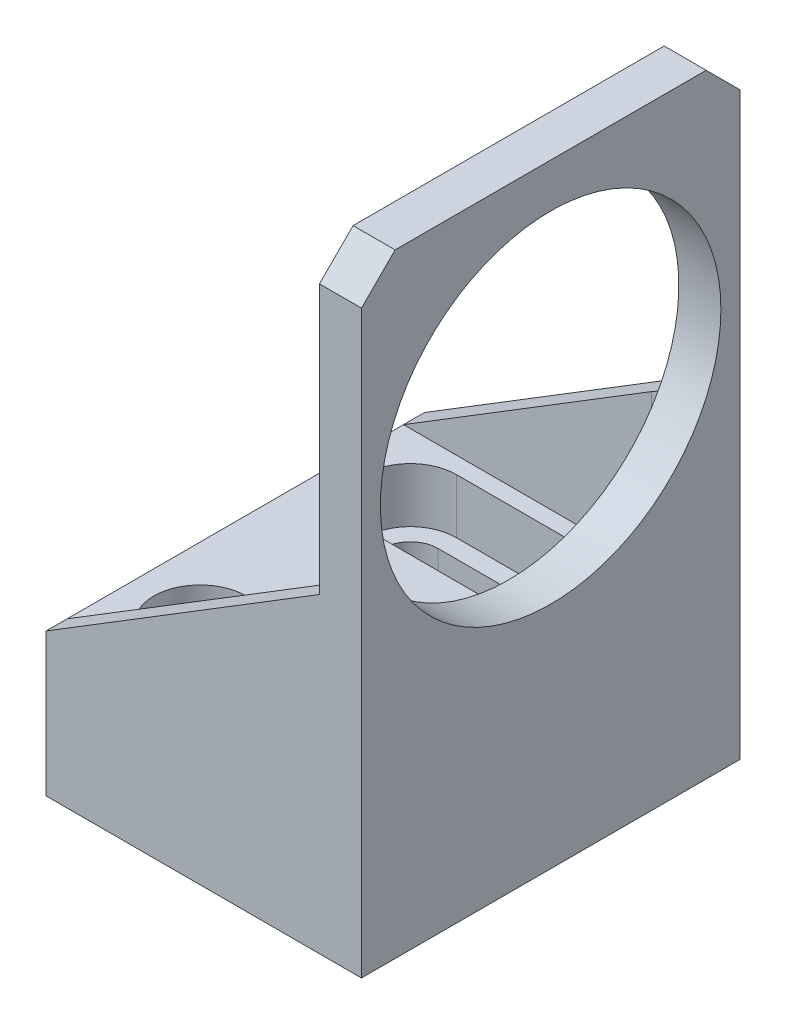
ISO-10303-21;
HEADER;
FILE_DESCRIPTION(('STEP AP214'),'2;1');
FILE_NAME('part.step','',(''),(''),'','','');
FILE_SCHEMA(('AUTOMOTIVE_DESIGN { 1 0 10303 214 1 1 1 1 }'));
ENDSEC;
DATA;
#1=APPLICATION_CONTEXT('core data for automotive mechanical design processes');
#2=APPLICATION_PROTOCOL_DEFINITION('international standard','automotive_design',2000,#1);
#3=PRODUCT_CONTEXT('',#1,'mechanical');
#4=PRODUCT('Part','Part','',(#3));
#5=PRODUCT_RELATED_PRODUCT_CATEGORY('part','',(#4));
#6=PRODUCT_DEFINITION_FORMATION('','',#4);
#7=PRODUCT_DEFINITION_CONTEXT('part definition',#1,'design');
#8=PRODUCT_DEFINITION('design','',#6,#7);
#9=PRODUCT_DEFINITION_SHAPE('','',#8);
#10=(LENGTH_UNIT() NAMED_UNIT(*) SI_UNIT(.MILLI.,.METRE.));
#11=(NAMED_UNIT(*) PLANE_ANGLE_UNIT() SI_UNIT($,.RADIAN.));
#12=(NAMED_UNIT(*) SI_UNIT($,.STERADIAN.) SOLID_ANGLE_UNIT());
#13=UNCERTAINTY_MEASURE_WITH_UNIT(LENGTH_MEASURE(1.E-05),#10,'distance_accuracy_value','');
#14=(GEOMETRIC_REPRESENTATION_CONTEXT(3) GLOBAL_UNCERTAINTY_ASSIGNED_CONTEXT((#13)) GLOBAL_UNIT_ASSIGNED_CONTEXT((#10,
#11,#12)) REPRESENTATION_CONTEXT('',''));
#15=CARTESIAN_POINT('',(0.,0.,0.));
#16=DIRECTION('',(0.,0.,1.));
#17=DIRECTION('',(1.,0.,0.));
#18=AXIS2_PLACEMENT_3D('',#15,#16,#17);
#19=CARTESIAN_POINT('',(0.,0.,0.));
#20=DIRECTION('',(-1.,0.,0.));
#21=DIRECTION('',(0.,0.,1.));
#22=AXIS2_PLACEMENT_3D('',#19,#20,#21);
#23=PLANE('',#22);
#24=DIRECTION('',(0.,0.,-1.));
#25=VECTOR('',#24,1.);
#26=CARTESIAN_POINT('',(0.,37.,-20.));
#27=LINE('',#26,#25);
#28=CARTESIAN_POINT('',(0.,37.,-17.3150945709228));
#29=VERTEX_POINT('',#28);
#30=CARTESIAN_POINT('',(0.,37.,-22.5));
#31=VERTEX_POINT('',#30);
#32=EDGE_CURVE('E213',#29,#31,#27,.T.);
#33=ORIENTED_EDGE('',*,*,#32,.F.);
#34=CARTESIAN_POINT('',(0.,47.5,0.));
#35=DIRECTION('',(1.,0.,0.));
#36=DIRECTION('',(0.,0.,-1.));
#37=AXIS2_PLACEMENT_3D('',#34,#35,#36);
#38=CIRCLE('',#37,20.25);
#39=CARTESIAN_POINT('',(0.,37.,17.3150945709228));
#40=VERTEX_POINT('',#39);
#41=EDGE_CURVE('E435',#29,#40,#38,.T.);
#42=ORIENTED_EDGE('',*,*,#41,.T.);
#43=DIRECTION('',(0.,0.,1.));
#44=VECTOR('',#43,1.);
#45=CARTESIAN_POINT('',(0.,37.,20.));
#46=LINE('',#45,#44);
#47=CARTESIAN_POINT('',(0.,37.,22.5));
#48=VERTEX_POINT('',#47);
#49=EDGE_CURVE('E616',#40,#48,#46,.T.);
#50=ORIENTED_EDGE('',*,*,#49,.T.);
#51=DIRECTION('',(0.,-1.,0.));
#52=VECTOR('',#51,1.);
#53=CARTESIAN_POINT('',(0.,0.,22.5));
#54=LINE('',#53,#52);
#55=CARTESIAN_POINT('',(0.,69.,22.5));
#56=VERTEX_POINT('',#55);
#57=EDGE_CURVE('E449',#56,#48,#54,.T.);
#58=ORIENTED_EDGE('',*,*,#57,.F.);
#59=DIRECTION('',(0.,-0.707106781186546,0.707106781186549));
#60=VECTOR('',#59,1.);
#61=CARTESIAN_POINT('',(0.,45.7500000000002,45.7499999999999));
#62=LINE('',#61,#60);
#63=CARTESIAN_POINT('',(0.,73.,18.5));
#64=VERTEX_POINT('',#63);
#65=EDGE_CURVE('E491',#56,#64,#62,.F.);
#66=ORIENTED_EDGE('',*,*,#65,.T.);
#67=DIRECTION('',(0.,0.,1.));
#68=VECTOR('',#67,1.);
#69=CARTESIAN_POINT('',(0.,73.,22.5));
#70=LINE('',#69,#68);
#71=CARTESIAN_POINT('',(0.,73.,-18.5));
#72=VERTEX_POINT('',#71);
#73=EDGE_CURVE('E458',#72,#64,#70,.T.);
#74=ORIENTED_EDGE('',*,*,#73,.F.);
#75=DIRECTION('',(0.,0.707106781186548,0.707106781186547));
#76=VECTOR('',#75,1.);
#77=CARTESIAN_POINT('',(0.,45.7499999999999,-45.75));
#78=LINE('',#77,#76);
#79=CARTESIAN_POINT('',(0.,69.,-22.5));
#80=VERTEX_POINT('',#79);
#81=EDGE_CURVE('E494',#72,#80,#78,.F.);
#82=ORIENTED_EDGE('',*,*,#81,.T.);
#83=DIRECTION('',(0.,1.,0.));
#84=VECTOR('',#83,1.);
#85=CARTESIAN_POINT('',(0.,0.,-22.5));
#86=LINE('',#85,#84);
#87=EDGE_CURVE('E473',#31,#80,#86,.T.);
#88=ORIENTED_EDGE('',*,*,#87,.F.);
#89=EDGE_LOOP('',(#33,#42,#50,#58,#66,#74,#82,#88));
#90=FACE_BOUND('',#89,.T.);
#91=ADVANCED_FACE('F189',(#90),#23,.T.);
#92=CARTESIAN_POINT('',(0.,36.4971594576673,17.));
#93=VERTEX_POINT('',#92);
#94=CARTESIAN_POINT('',(0.,36.4971594576673,-17.));
#95=VERTEX_POINT('',#94);
#96=EDGE_CURVE('E450',#93,#95,#38,.T.);
#97=ORIENTED_EDGE('',*,*,#96,.T.);
#98=DIRECTION('',(0.,1.,0.));
#99=VECTOR('',#98,1.);
#100=CARTESIAN_POINT('',(0.,17.,-17.));
#101=LINE('',#100,#99);
#102=CARTESIAN_POINT('',(0.,17.,-17.));
#103=VERTEX_POINT('',#102);
#104=EDGE_CURVE('E589',#95,#103,#101,.F.);
#105=ORIENTED_EDGE('',*,*,#104,.T.);
#106=DIRECTION('',(0.,0.,1.));
#107=VECTOR('',#106,1.);
#108=CARTESIAN_POINT('',(0.,17.,-22.5));
#109=LINE('',#108,#107);
#110=CARTESIAN_POINT('',(0.,17.,17.));
#111=VERTEX_POINT('',#110);
#112=EDGE_CURVE('E440',#103,#111,#109,.T.);
#113=ORIENTED_EDGE('',*,*,#112,.T.);
#114=DIRECTION('',(0.,1.,0.));
#115=VECTOR('',#114,1.);
#116=CARTESIAN_POINT('',(0.,37.,17.));
#117=LINE('',#116,#115);
#118=EDGE_CURVE('E543',#111,#93,#117,.T.);
#119=ORIENTED_EDGE('',*,*,#118,.T.);
#120=EDGE_LOOP('',(#97,#105,#113,#119));
#121=FACE_BOUND('',#120,.T.);
#122=ADVANCED_FACE('F790',(#121),#23,.T.);
#123=CARTESIAN_POINT('',(5.,0.,0.));
#124=DIRECTION('',(-1.,0.,0.));
#125=DIRECTION('',(0.,0.,1.));
#126=AXIS2_PLACEMENT_3D('',#123,#124,#125);
#127=PLANE('',#126);
#128=DIRECTION('',(0.,1.,0.));
#129=VECTOR('',#128,1.);
#130=CARTESIAN_POINT('',(5.,0.,-22.5));
#131=LINE('',#130,#129);
#132=CARTESIAN_POINT('',(5.,0.,-22.5));
#133=VERTEX_POINT('',#132);
#134=CARTESIAN_POINT('',(5.,69.,-22.5));
#135=VERTEX_POINT('',#134);
#136=EDGE_CURVE('E461',#133,#135,#131,.T.);
#137=ORIENTED_EDGE('',*,*,#136,.T.);
#138=DIRECTION('',(0.,-0.707106781186548,-0.707106781186547));
#139=VECTOR('',#138,1.);
#140=CARTESIAN_POINT('',(5.,73.,-18.5));
#141=LINE('',#140,#139);
#142=CARTESIAN_POINT('',(5.,73.,-18.5));
#143=VERTEX_POINT('',#142);
#144=EDGE_CURVE('E504',#135,#143,#141,.F.);
#145=ORIENTED_EDGE('',*,*,#144,.T.);
#146=DIRECTION('',(0.,0.,1.));
#147=VECTOR('',#146,1.);
#148=CARTESIAN_POINT('',(5.,73.,22.5));
#149=LINE('',#148,#147);
#150=CARTESIAN_POINT('',(5.,73.,18.5));
#151=VERTEX_POINT('',#150);
#152=EDGE_CURVE('E465',#143,#151,#149,.T.);
#153=ORIENTED_EDGE('',*,*,#152,.T.);
#154=DIRECTION('',(0.,0.707106781186546,-0.707106781186549));
#155=VECTOR('',#154,1.);
#156=CARTESIAN_POINT('',(5.,69.,22.5));
#157=LINE('',#156,#155);
#158=CARTESIAN_POINT('',(5.,69.,22.5));
#159=VERTEX_POINT('',#158);
#160=EDGE_CURVE('E501',#151,#159,#157,.F.);
#161=ORIENTED_EDGE('',*,*,#160,.T.);
#162=DIRECTION('',(0.,-1.,0.));
#163=VECTOR('',#162,1.);
#164=CARTESIAN_POINT('',(5.,0.,22.5));
#165=LINE('',#164,#163);
#166=CARTESIAN_POINT('',(5.,0.,22.5));
#167=VERTEX_POINT('',#166);
#168=EDGE_CURVE('E454',#159,#167,#165,.T.);
#169=ORIENTED_EDGE('',*,*,#168,.T.);
#170=DIRECTION('',(0.,0.,-1.));
#171=VECTOR('',#170,1.);
#172=CARTESIAN_POINT('',(5.,0.,22.5));
#173=LINE('',#172,#171);
#174=EDGE_CURVE('E457',#167,#133,#173,.T.);
#175=ORIENTED_EDGE('',*,*,#174,.T.);
#176=EDGE_LOOP('',(#137,#145,#153,#161,#169,#175));
#177=FACE_BOUND('',#176,.T.);
#178=CARTESIAN_POINT('',(5.,47.5,0.));
#179=DIRECTION('',(1.,0.,0.));
#180=DIRECTION('',(0.,0.,-1.));
#181=AXIS2_PLACEMENT_3D('',#178,#179,#180);
#182=CIRCLE('',#181,20.25);
#183=CARTESIAN_POINT('',(5.,47.5,-20.25));
#184=VERTEX_POINT('',#183);
#185=EDGE_CURVE('E445',#184,#184,#182,.T.);
#186=ORIENTED_EDGE('',*,*,#185,.F.);
#187=EDGE_LOOP('',(#186));
#188=FACE_BOUND('',#187,.T.);
#189=ADVANCED_FACE('F576',(#177,#188),#127,.F.);
#190=CARTESIAN_POINT('',(5.,0.,22.5));
#191=DIRECTION('',(0.,0.,-1.));
#192=DIRECTION('',(-1.,0.,0.));
#193=AXIS2_PLACEMENT_3D('',#190,#191,#192);
#194=PLANE('',#193);
#195=ORIENTED_EDGE('',*,*,#57,.T.);
#196=DIRECTION('',(-0.851658316704544,-0.524097425664335,0.));
#197=VECTOR('',#196,1.);
#198=CARTESIAN_POINT('',(0.,37.,22.5));
#199=LINE('',#198,#197);
#200=CARTESIAN_POINT('',(-32.5,17.,22.5));
#201=VERTEX_POINT('',#200);
#202=EDGE_CURVE('E611',#48,#201,#199,.T.);
#203=ORIENTED_EDGE('',*,*,#202,.T.);
#204=DIRECTION('',(0.,-1.,0.));
#205=VECTOR('',#204,1.);
#206=CARTESIAN_POINT('',(-32.5,17.,22.5));
#207=LINE('',#206,#205);
#208=CARTESIAN_POINT('',(-32.5,0.,22.5));
#209=VERTEX_POINT('',#208);
#210=EDGE_CURVE('E432',#201,#209,#207,.T.);
#211=ORIENTED_EDGE('',*,*,#210,.T.);
#212=DIRECTION('',(-1.,0.,0.));
#213=VECTOR('',#212,1.);
#214=CARTESIAN_POINT('',(5.,0.,22.5));
#215=LINE('',#214,#213);
#216=EDGE_CURVE('E481',#167,#209,#215,.T.);
#217=ORIENTED_EDGE('',*,*,#216,.F.);
#218=ORIENTED_EDGE('',*,*,#168,.F.);
#219=DIRECTION('',(-1.,0.,0.));
#220=VECTOR('',#219,1.);
#221=CARTESIAN_POINT('',(5.,69.,22.5));
#222=LINE('',#221,#220);
#223=EDGE_CURVE('E507',#159,#56,#222,.T.);
#224=ORIENTED_EDGE('',*,*,#223,.T.);
#225=EDGE_LOOP('',(#195,#203,#211,#217,#218,#224));
#226=FACE_BOUND('',#225,.T.);
#227=ADVANCED_FACE('F783',(#226),#194,.F.);
#228=CARTESIAN_POINT('',(5.,0.,22.5));
#229=DIRECTION('',(0.,1.,0.));
#230=DIRECTION('',(0.,0.,1.));
#231=AXIS2_PLACEMENT_3D('',#228,#229,#230);
#232=PLANE('',#231);
#233=CARTESIAN_POINT('',(-5.8,0.,-12.5));
#234=DIRECTION('',(0.,1.,0.));
#235=DIRECTION('',(0.,0.,1.));
#236=AXIS2_PLACEMENT_3D('',#233,#234,#235);
#237=CIRCLE('',#236,3.3);
#238=CARTESIAN_POINT('',(-5.8,0.,-9.2));
#239=VERTEX_POINT('',#238);
#240=CARTESIAN_POINT('',(-5.8,0.,-15.8));
#241=VERTEX_POINT('',#240);
#242=EDGE_CURVE('E535',#239,#241,#237,.T.);
#243=ORIENTED_EDGE('',*,*,#242,.T.);
#244=DIRECTION('',(-1.,0.,0.));
#245=VECTOR('',#244,1.);
#246=CARTESIAN_POINT('',(5.,0.,-15.8));
#247=LINE('',#246,#245);
#248=CARTESIAN_POINT('',(-24.2,0.,-15.8));
#249=VERTEX_POINT('',#248);
#250=EDGE_CURVE('E539',#241,#249,#247,.T.);
#251=ORIENTED_EDGE('',*,*,#250,.T.);
#252=CARTESIAN_POINT('',(-24.2,0.,-12.5));
#253=DIRECTION('',(0.,1.,0.));
#254=DIRECTION('',(0.,0.,1.));
#255=AXIS2_PLACEMENT_3D('',#252,#253,#254);
#256=CIRCLE('',#255,3.3);
#257=CARTESIAN_POINT('',(-24.2,0.,-9.20000000000001));
#258=VERTEX_POINT('',#257);
#259=EDGE_CURVE('E531',#249,#258,#256,.T.);
#260=ORIENTED_EDGE('',*,*,#259,.T.);
#261=DIRECTION('',(1.,0.,0.));
#262=VECTOR('',#261,1.);
#263=CARTESIAN_POINT('',(5.,0.,-9.20000000000001));
#264=LINE('',#263,#262);
#265=EDGE_CURVE('E527',#258,#239,#264,.T.);
#266=ORIENTED_EDGE('',*,*,#265,.T.);
#267=EDGE_LOOP('',(#243,#251,#260,#266));
#268=FACE_BOUND('',#267,.T.);
#269=CARTESIAN_POINT('',(-5.8,0.,12.5));
#270=DIRECTION('',(0.,1.,0.));
#271=DIRECTION('',(0.,0.,1.));
#272=AXIS2_PLACEMENT_3D('',#269,#270,#271);
#273=CIRCLE('',#272,3.3);
#274=CARTESIAN_POINT('',(-5.8,0.,15.8));
#275=VERTEX_POINT('',#274);
#276=CARTESIAN_POINT('',(-5.8,0.,9.2));
#277=VERTEX_POINT('',#276);
#278=EDGE_CURVE('E519',#275,#277,#273,.T.);
#279=ORIENTED_EDGE('',*,*,#278,.T.);
#280=DIRECTION('',(-1.,0.,0.));
#281=VECTOR('',#280,1.);
#282=CARTESIAN_POINT('',(5.,0.,9.2));
#283=LINE('',#282,#281);
#284=CARTESIAN_POINT('',(-24.2,0.,9.2));
#285=VERTEX_POINT('',#284);
#286=EDGE_CURVE('E523',#277,#285,#283,.T.);
#287=ORIENTED_EDGE('',*,*,#286,.T.);
#288=CARTESIAN_POINT('',(-24.2,0.,12.5));
#289=DIRECTION('',(0.,1.,0.));
#290=DIRECTION('',(0.,0.,1.));
#291=AXIS2_PLACEMENT_3D('',#288,#289,#290);
#292=CIRCLE('',#291,3.3);
#293=CARTESIAN_POINT('',(-24.2,0.,15.8));
#294=VERTEX_POINT('',#293);
#295=EDGE_CURVE('E515',#285,#294,#292,.T.);
#296=ORIENTED_EDGE('',*,*,#295,.T.);
#297=DIRECTION('',(1.,0.,0.));
#298=VECTOR('',#297,1.);
#299=CARTESIAN_POINT('',(5.,0.,15.8));
#300=LINE('',#299,#298);
#301=EDGE_CURVE('E511',#294,#275,#300,.T.);
#302=ORIENTED_EDGE('',*,*,#301,.T.);
#303=EDGE_LOOP('',(#279,#287,#296,#302));
#304=FACE_BOUND('',#303,.T.);
#305=ORIENTED_EDGE('',*,*,#216,.T.);
#306=DIRECTION('',(0.,0.,-1.));
#307=VECTOR('',#306,1.);
#308=CARTESIAN_POINT('',(-32.5,0.,22.5));
#309=LINE('',#308,#307);
#310=CARTESIAN_POINT('',(-32.5,0.,-22.5));
#311=VERTEX_POINT('',#310);
#312=EDGE_CURVE('E443',#209,#311,#309,.T.);
#313=ORIENTED_EDGE('',*,*,#312,.T.);
#314=DIRECTION('',(-1.,0.,0.));
#315=VECTOR('',#314,1.);
#316=CARTESIAN_POINT('',(5.,0.,-22.5));
#317=LINE('',#316,#315);
#318=EDGE_CURVE('E469',#133,#311,#317,.T.);
#319=ORIENTED_EDGE('',*,*,#318,.F.);
#320=ORIENTED_EDGE('',*,*,#174,.F.);
#321=EDGE_LOOP('',(#305,#313,#319,#320));
#322=FACE_BOUND('',#321,.T.);
#323=ADVANCED_FACE('F812',(#268,#304,#322),#232,.F.);
#324=CARTESIAN_POINT('',(5.,0.,-22.5));
#325=DIRECTION('',(0.,0.,1.));
#326=DIRECTION('',(1.,0.,0.));
#327=AXIS2_PLACEMENT_3D('',#324,#325,#326);
#328=PLANE('',#327);
#329=DIRECTION('',(-0.851658316704544,-0.524097425664335,0.));
#330=VECTOR('',#329,1.);
#331=CARTESIAN_POINT('',(0.,37.,-22.5));
#332=LINE('',#331,#330);
#333=CARTESIAN_POINT('',(-32.5,17.,-22.5));
#334=VERTEX_POINT('',#333);
#335=EDGE_CURVE('E426',#31,#334,#332,.T.);
#336=ORIENTED_EDGE('',*,*,#335,.F.);
#337=ORIENTED_EDGE('',*,*,#87,.T.);
#338=DIRECTION('',(1.,0.,0.));
#339=VECTOR('',#338,1.);
#340=CARTESIAN_POINT('',(5.,69.,-22.5));
#341=LINE('',#340,#339);
#342=EDGE_CURVE('E498',#80,#135,#341,.T.);
#343=ORIENTED_EDGE('',*,*,#342,.T.);
#344=ORIENTED_EDGE('',*,*,#136,.F.);
#345=ORIENTED_EDGE('',*,*,#318,.T.);
#346=DIRECTION('',(0.,1.,0.));
#347=VECTOR('',#346,1.);
#348=CARTESIAN_POINT('',(-32.5,0.,-22.5));
#349=LINE('',#348,#347);
#350=EDGE_CURVE('E418',#311,#334,#349,.T.);
#351=ORIENTED_EDGE('',*,*,#350,.T.);
#352=EDGE_LOOP('',(#336,#337,#343,#344,#345,#351));
#353=FACE_BOUND('',#352,.T.);
#354=ADVANCED_FACE('F779',(#353),#328,.F.);
#355=CARTESIAN_POINT('',(5.,73.,22.5));
#356=DIRECTION('',(0.,-1.,0.));
#357=DIRECTION('',(0.,0.,-1.));
#358=AXIS2_PLACEMENT_3D('',#355,#356,#357);
#359=PLANE('',#358);
#360=ORIENTED_EDGE('',*,*,#152,.F.);
#361=DIRECTION('',(-1.,0.,0.));
#362=VECTOR('',#361,1.);
#363=CARTESIAN_POINT('',(5.,73.,-18.5));
#364=LINE('',#363,#362);
#365=EDGE_CURVE('E487',#143,#72,#364,.T.);
#366=ORIENTED_EDGE('',*,*,#365,.T.);
#367=ORIENTED_EDGE('',*,*,#73,.T.);
#368=DIRECTION('',(1.,0.,0.));
#369=VECTOR('',#368,1.);
#370=CARTESIAN_POINT('',(5.,73.,18.5));
#371=LINE('',#370,#369);
#372=EDGE_CURVE('E484',#64,#151,#371,.T.);
#373=ORIENTED_EDGE('',*,*,#372,.T.);
#374=EDGE_LOOP('',(#360,#366,#367,#373));
#375=FACE_BOUND('',#374,.T.);
#376=ADVANCED_FACE('F573',(#375),#359,.F.);
#377=CARTESIAN_POINT('',(5.,47.5,0.));
#378=DIRECTION('',(-1.,0.,0.));
#379=DIRECTION('',(0.,0.,1.));
#380=AXIS2_PLACEMENT_3D('',#377,#378,#379);
#381=CYLINDRICAL_SURFACE('',#380,20.25);
#382=ORIENTED_EDGE('',*,*,#185,.T.);
#383=EDGE_LOOP('',(#382));
#384=FACE_BOUND('',#383,.T.);
#385=ORIENTED_EDGE('',*,*,#96,.F.);
#386=CARTESIAN_POINT('',(0.,36.4971594576673,17.));
#387=CARTESIAN_POINT('',(-1.87730750983537E-05,36.631778714722,17.0871342220285));
#388=CARTESIAN_POINT('',(-0.00379528812989197,36.767408182586,17.172643217437));
#389=CARTESIAN_POINT('',(-0.0181651697236299,37.0403457240913,17.3402341699975));
#390=CARTESIAN_POINT('',(-0.0287559085618988,37.177653130672,17.4223174351923));
#391=CARTESIAN_POINT('',(-0.0559711898135035,37.4528443621998,17.5824446473561));
#392=CARTESIAN_POINT('',(-0.0725575221623428,37.5907191892968,17.6605106752522));
#393=CARTESIAN_POINT('',(-0.111211779846979,37.8676692726443,17.8130769428276));
#394=CARTESIAN_POINT('',(-0.133280247611083,38.0067446463674,17.8875768287856));
#395=CARTESIAN_POINT('',(-0.206929316997403,38.4253438365513,18.1055795781002));
#396=CARTESIAN_POINT('',(-0.265972374079489,38.706417750355,18.2436883861877));
#397=CARTESIAN_POINT('',(-0.367318591546826,39.1308662044017,18.440299905632));
#398=CARTESIAN_POINT('',(-0.403368954259783,39.2732888568415,18.5042687277381));
#399=CARTESIAN_POINT('',(-0.47944165155369,39.5586589279134,18.628521196671));
#400=CARTESIAN_POINT('',(-0.519463491237028,39.7016062790286,18.6888053011522));
#401=CARTESIAN_POINT('',(-0.56134061130716,39.8447732222212,18.747266546907));
#402=B_SPLINE_CURVE_WITH_KNOTS('',3,(#386,#387,#388,#389,#390,#391,#392,#393,#394,#395,#396,
#397,#398,#399,#400,#401),.UNSPECIFIED.,.F.,.F.,(4,2,2,2,2,2,2,4),(0.,0.480967981834138,
0.961750603885109,1.43952170005934,1.91734008799896,2.87236178698792,3.35300280856096,
3.83358401105418),.UNSPECIFIED.);
#403=CARTESIAN_POINT('',(-0.0159695356537035,36.9901725934439,17.3091313440161));
#404=VERTEX_POINT('',#403);
#405=EDGE_CURVE('E554',#93,#404,#402,.T.);
#406=ORIENTED_EDGE('',*,*,#405,.T.);
#407=CARTESIAN_POINT('',(17.0625,47.5,0.));
#408=DIRECTION('',(-0.524097425664335,0.851658316704544,0.));
#409=DIRECTION('',(-0.851658316704544,-0.524097425664335,0.));
#410=AXIS2_PLACEMENT_3D('',#407,#408,#409);
#411=ELLIPSE('',#410,38.6378543537617,20.25);
#412=EDGE_CURVE('E593',#40,#404,#411,.F.);
#413=ORIENTED_EDGE('',*,*,#412,.F.);
#414=ORIENTED_EDGE('',*,*,#41,.F.);
#415=CARTESIAN_POINT('',(17.0625,47.5,0.));
#416=DIRECTION('',(0.524097425664335,-0.851658316704544,0.));
#417=DIRECTION('',(-0.851658316704544,-0.524097425664335,0.));
#418=AXIS2_PLACEMENT_3D('',#415,#416,#417);
#419=ELLIPSE('',#418,38.6378543537617,20.25);
#420=CARTESIAN_POINT('',(-0.0159695356537035,36.9901725934439,-17.3091313440161));
#421=VERTEX_POINT('',#420);
#422=EDGE_CURVE('E13',#29,#421,#419,.F.);
#423=ORIENTED_EDGE('',*,*,#422,.T.);
#424=CARTESIAN_POINT('',(0.,36.4971594576673,-17.));
#425=CARTESIAN_POINT('',(-1.87730750983537E-05,36.631778714722,-17.0871342220285));
#426=CARTESIAN_POINT('',(-0.00379528812989197,36.767408182586,-17.172643217437));
#427=CARTESIAN_POINT('',(-0.0181651697236299,37.0403457240913,-17.3402341699975));
#428=CARTESIAN_POINT('',(-0.0287559085618988,37.177653130672,-17.4223174351923));
#429=CARTESIAN_POINT('',(-0.0559711898135035,37.4528443621998,-17.5824446473561));
#430=CARTESIAN_POINT('',(-0.0725575221623428,37.5907191892968,-17.6605106752522));
#431=CARTESIAN_POINT('',(-0.111211779846979,37.8676692726443,-17.8130769428276));
#432=CARTESIAN_POINT('',(-0.133280247611083,38.0067446463674,-17.8875768287856));
#433=CARTESIAN_POINT('',(-0.206929316997403,38.4253438365513,-18.1055795781002));
#434=CARTESIAN_POINT('',(-0.265972374079489,38.706417750355,-18.2436883861877));
#435=CARTESIAN_POINT('',(-0.367318591546826,39.1308662044017,-18.440299905632));
#436=CARTESIAN_POINT('',(-0.403368954259783,39.2732888568415,-18.5042687277381));
#437=CARTESIAN_POINT('',(-0.47944165155369,39.5586589279134,-18.628521196671));
#438=CARTESIAN_POINT('',(-0.519463491237028,39.7016062790286,-18.6888053011522));
#439=CARTESIAN_POINT('',(-0.56134061130716,39.8447732222212,-18.747266546907));
#440=B_SPLINE_CURVE_WITH_KNOTS('',3,(#424,#425,#426,#427,#428,#429,#430,#431,#432,#433,#434,
#435,#436,#437,#438,#439),.UNSPECIFIED.,.F.,.F.,(4,2,2,2,2,2,2,4),(0.,0.480967981834138,
0.961750603885109,1.43952170005934,1.91734008799896,2.87236178698792,3.35300280856096,
3.83358401105418),.UNSPECIFIED.);
#441=EDGE_CURVE('E199',#421,#95,#440,.F.);
#442=ORIENTED_EDGE('',*,*,#441,.T.);
#443=EDGE_LOOP('',(#385,#406,#413,#414,#423,#442));
#444=FACE_BOUND('',#443,.T.);
#445=ADVANCED_FACE('F567',(#384,#444),#381,.F.);
#446=CARTESIAN_POINT('',(5.,73.,-18.5));
#447=DIRECTION('',(0.,-0.707106781186547,0.707106781186548));
#448=DIRECTION('',(-1.,0.,0.));
#449=AXIS2_PLACEMENT_3D('',#446,#447,#448);
#450=PLANE('',#449);
#451=ORIENTED_EDGE('',*,*,#144,.F.);
#452=ORIENTED_EDGE('',*,*,#342,.F.);
#453=ORIENTED_EDGE('',*,*,#81,.F.);
#454=ORIENTED_EDGE('',*,*,#365,.F.);
#455=EDGE_LOOP('',(#451,#452,#453,#454));
#456=FACE_BOUND('',#455,.T.);
#457=ADVANCED_FACE('F572',(#456),#450,.F.);
#458=CARTESIAN_POINT('',(5.,69.,22.5));
#459=DIRECTION('',(0.,-0.707106781186549,-0.707106781186546));
#460=DIRECTION('',(-1.,0.,0.));
#461=AXIS2_PLACEMENT_3D('',#458,#459,#460);
#462=PLANE('',#461);
#463=ORIENTED_EDGE('',*,*,#160,.F.);
#464=ORIENTED_EDGE('',*,*,#372,.F.);
#465=ORIENTED_EDGE('',*,*,#65,.F.);
#466=ORIENTED_EDGE('',*,*,#223,.F.);
#467=EDGE_LOOP('',(#463,#464,#465,#466));
#468=FACE_BOUND('',#467,.T.);
#469=ADVANCED_FACE('F819',(#468),#462,.F.);
#470=CARTESIAN_POINT('',(-32.5,17.,-22.5));
#471=DIRECTION('',(0.,1.,0.));
#472=DIRECTION('',(0.,0.,1.));
#473=AXIS2_PLACEMENT_3D('',#470,#471,#472);
#474=PLANE('',#473);
#475=ORIENTED_EDGE('',*,*,#112,.F.);
#476=CARTESIAN_POINT('',(-3.,17.,-17.));
#477=DIRECTION('',(0.,1.,0.));
#478=DIRECTION('',(0.,0.,1.));
#479=AXIS2_PLACEMENT_3D('',#476,#477,#478);
#480=CIRCLE('',#479,3.);
#481=CARTESIAN_POINT('',(-3.,17.,-20.));
#482=VERTEX_POINT('',#481);
#483=EDGE_CURVE('E424',#103,#482,#480,.T.);
#484=ORIENTED_EDGE('',*,*,#483,.T.);
#485=DIRECTION('',(1.,0.,0.));
#486=VECTOR('',#485,1.);
#487=CARTESIAN_POINT('',(-32.5,17.,-20.));
#488=LINE('',#487,#486);
#489=CARTESIAN_POINT('',(-32.5,17.,-20.));
#490=VERTEX_POINT('',#489);
#491=EDGE_CURVE('E397',#490,#482,#488,.T.);
#492=ORIENTED_EDGE('',*,*,#491,.F.);
#493=DIRECTION('',(0.,0.,1.));
#494=VECTOR('',#493,1.);
#495=CARTESIAN_POINT('',(-32.5,17.,-22.5));
#496=LINE('',#495,#494);
#497=CARTESIAN_POINT('',(-32.5,17.,20.));
#498=VERTEX_POINT('',#497);
#499=EDGE_CURVE('E405',#490,#498,#496,.T.);
#500=ORIENTED_EDGE('',*,*,#499,.T.);
#501=DIRECTION('',(1.,0.,0.));
#502=VECTOR('',#501,1.);
#503=CARTESIAN_POINT('',(-32.5,17.,20.));
#504=LINE('',#503,#502);
#505=CARTESIAN_POINT('',(-3.,17.,20.));
#506=VERTEX_POINT('',#505);
#507=EDGE_CURVE('E609',#498,#506,#504,.T.);
#508=ORIENTED_EDGE('',*,*,#507,.T.);
#509=CARTESIAN_POINT('',(-3.,17.,17.));
#510=DIRECTION('',(0.,1.,0.));
#511=DIRECTION('',(0.,0.,1.));
#512=AXIS2_PLACEMENT_3D('',#509,#510,#511);
#513=CIRCLE('',#512,3.);
#514=EDGE_CURVE('E550',#506,#111,#513,.T.);
#515=ORIENTED_EDGE('',*,*,#514,.T.);
#516=EDGE_LOOP('',(#475,#484,#492,#500,#508,#515));
#517=FACE_BOUND('',#516,.T.);
#518=DIRECTION('',(1.,0.,0.));
#519=VECTOR('',#518,1.);
#520=CARTESIAN_POINT('',(-24.2,17.,-7.00000000000003));
#521=LINE('',#520,#519);
#522=CARTESIAN_POINT('',(-24.2,17.,-7.));
#523=VERTEX_POINT('',#522);
#524=CARTESIAN_POINT('',(-5.8,17.,-7.00000000000003));
#525=VERTEX_POINT('',#524);
#526=EDGE_CURVE('E626',#523,#525,#521,.T.);
#527=ORIENTED_EDGE('',*,*,#526,.F.);
#528=CARTESIAN_POINT('',(-24.2,17.,-12.5));
#529=DIRECTION('',(0.,1.,0.));
#530=DIRECTION('',(0.,0.,1.));
#531=AXIS2_PLACEMENT_3D('',#528,#529,#530);
#532=CIRCLE('',#531,5.5);
#533=CARTESIAN_POINT('',(-24.2,17.,-18.));
#534=VERTEX_POINT('',#533);
#535=EDGE_CURVE('E656',#534,#523,#532,.T.);
#536=ORIENTED_EDGE('',*,*,#535,.F.);
#537=DIRECTION('',(1.,0.,0.));
#538=VECTOR('',#537,1.);
#539=CARTESIAN_POINT('',(-24.2,17.,-18.));
#540=LINE('',#539,#538);
#541=CARTESIAN_POINT('',(-5.8,17.,-18.));
#542=VERTEX_POINT('',#541);
#543=EDGE_CURVE('E645',#534,#542,#540,.T.);
#544=ORIENTED_EDGE('',*,*,#543,.T.);
#545=CARTESIAN_POINT('',(-5.8,17.,-12.5));
#546=DIRECTION('',(0.,1.,0.));
#547=DIRECTION('',(0.,0.,1.));
#548=AXIS2_PLACEMENT_3D('',#545,#546,#547);
#549=CIRCLE('',#548,5.5);
#550=EDGE_CURVE('E682',#525,#542,#549,.T.);
#551=ORIENTED_EDGE('',*,*,#550,.F.);
#552=EDGE_LOOP('',(#527,#536,#544,#551));
#553=FACE_BOUND('',#552,.T.);
#554=DIRECTION('',(1.,0.,0.));
#555=VECTOR('',#554,1.);
#556=CARTESIAN_POINT('',(-24.2,17.,18.));
#557=LINE('',#556,#555);
#558=CARTESIAN_POINT('',(-24.2,17.,18.));
#559=VERTEX_POINT('',#558);
#560=CARTESIAN_POINT('',(-5.8,17.,18.));
#561=VERTEX_POINT('',#560);
#562=EDGE_CURVE('E701',#559,#561,#557,.T.);
#563=ORIENTED_EDGE('',*,*,#562,.F.);
#564=CARTESIAN_POINT('',(-24.2,17.,12.5));
#565=DIRECTION('',(0.,1.,0.));
#566=DIRECTION('',(0.,0.,1.));
#567=AXIS2_PLACEMENT_3D('',#564,#565,#566);
#568=CIRCLE('',#567,5.5);
#569=CARTESIAN_POINT('',(-24.2,17.,7.));
#570=VERTEX_POINT('',#569);
#571=EDGE_CURVE('E730',#570,#559,#568,.T.);
#572=ORIENTED_EDGE('',*,*,#571,.F.);
#573=DIRECTION('',(1.,0.,0.));
#574=VECTOR('',#573,1.);
#575=CARTESIAN_POINT('',(-24.2,17.,7.));
#576=LINE('',#575,#574);
#577=CARTESIAN_POINT('',(-5.8,17.,7.));
#578=VERTEX_POINT('',#577);
#579=EDGE_CURVE('E719',#570,#578,#576,.T.);
#580=ORIENTED_EDGE('',*,*,#579,.T.);
#581=CARTESIAN_POINT('',(-5.8,17.,12.5));
#582=DIRECTION('',(0.,1.,0.));
#583=DIRECTION('',(0.,0.,1.));
#584=AXIS2_PLACEMENT_3D('',#581,#582,#583);
#585=CIRCLE('',#584,5.5);
#586=EDGE_CURVE('E756',#561,#578,#585,.T.);
#587=ORIENTED_EDGE('',*,*,#586,.F.);
#588=EDGE_LOOP('',(#563,#572,#580,#587));
#589=FACE_BOUND('',#588,.T.);
#590=ADVANCED_FACE('F421',(#517,#553,#589),#474,.T.);
#591=CARTESIAN_POINT('',(-32.5,0.,0.));
#592=DIRECTION('',(1.,0.,0.));
#593=DIRECTION('',(0.,0.,-1.));
#594=AXIS2_PLACEMENT_3D('',#591,#592,#593);
#595=PLANE('',#594);
#596=ORIENTED_EDGE('',*,*,#312,.F.);
#597=ORIENTED_EDGE('',*,*,#210,.F.);
#598=DIRECTION('',(0.,0.,1.));
#599=VECTOR('',#598,1.);
#600=CARTESIAN_POINT('',(-32.5,17.,20.));
#601=LINE('',#600,#599);
#602=EDGE_CURVE('E412',#498,#201,#601,.T.);
#603=ORIENTED_EDGE('',*,*,#602,.F.);
#604=ORIENTED_EDGE('',*,*,#499,.F.);
#605=EDGE_CURVE('E409',#334,#490,#496,.T.);
#606=ORIENTED_EDGE('',*,*,#605,.F.);
#607=ORIENTED_EDGE('',*,*,#350,.F.);
#608=EDGE_LOOP('',(#596,#597,#603,#604,#606,#607));
#609=FACE_BOUND('',#608,.T.);
#610=ADVANCED_FACE('F407',(#609),#595,.F.);
#611=CARTESIAN_POINT('',(-5.8,17.,12.5));
#612=DIRECTION('',(0.,1.,0.));
#613=DIRECTION('',(0.,0.,1.));
#614=AXIS2_PLACEMENT_3D('',#611,#612,#613);
#615=CYLINDRICAL_SURFACE('',#614,3.3);
#616=DIRECTION('',(0.,1.,0.));
#617=VECTOR('',#616,1.);
#618=CARTESIAN_POINT('',(-5.8,17.,15.8));
#619=LINE('',#618,#617);
#620=CARTESIAN_POINT('',(-5.8,10.5,15.8));
#621=VERTEX_POINT('',#620);
#622=EDGE_CURVE('E752',#621,#275,#619,.F.);
#623=ORIENTED_EDGE('',*,*,#622,.F.);
#624=CARTESIAN_POINT('',(-5.8,10.5,12.5));
#625=DIRECTION('',(0.,1.,0.));
#626=DIRECTION('',(0.,0.,1.));
#627=AXIS2_PLACEMENT_3D('',#624,#625,#626);
#628=CIRCLE('',#627,3.3);
#629=CARTESIAN_POINT('',(-5.8,10.5,9.2));
#630=VERTEX_POINT('',#629);
#631=EDGE_CURVE('E764',#621,#630,#628,.T.);
#632=ORIENTED_EDGE('',*,*,#631,.T.);
#633=DIRECTION('',(0.,1.,0.));
#634=VECTOR('',#633,1.);
#635=CARTESIAN_POINT('',(-5.8,17.,9.2));
#636=LINE('',#635,#634);
#637=EDGE_CURVE('E749',#277,#630,#636,.T.);
#638=ORIENTED_EDGE('',*,*,#637,.F.);
#639=ORIENTED_EDGE('',*,*,#278,.F.);
#640=EDGE_LOOP('',(#623,#632,#638,#639));
#641=FACE_BOUND('',#640,.T.);
#642=ADVANCED_FACE('F915',(#641),#615,.F.);
#643=CARTESIAN_POINT('',(-2.5,10.5,12.5));
#644=DIRECTION('',(0.,-1.,0.));
#645=DIRECTION('',(0.,0.,-1.));
#646=AXIS2_PLACEMENT_3D('',#643,#644,#645);
#647=PLANE('',#646);
#648=DIRECTION('',(1.,0.,0.));
#649=VECTOR('',#648,1.);
#650=CARTESIAN_POINT('',(-24.2,10.5,15.8));
#651=LINE('',#650,#649);
#652=CARTESIAN_POINT('',(-24.2,10.5,15.8));
#653=VERTEX_POINT('',#652);
#654=EDGE_CURVE('E708',#653,#621,#651,.T.);
#655=ORIENTED_EDGE('',*,*,#654,.F.);
#656=CARTESIAN_POINT('',(-24.2,10.5,12.5));
#657=DIRECTION('',(0.,1.,0.));
#658=DIRECTION('',(0.,0.,1.));
#659=AXIS2_PLACEMENT_3D('',#656,#657,#658);
#660=CIRCLE('',#659,3.3);
#661=CARTESIAN_POINT('',(-24.2,10.5,9.2));
#662=VERTEX_POINT('',#661);
#663=EDGE_CURVE('E738',#662,#653,#660,.T.);
#664=ORIENTED_EDGE('',*,*,#663,.F.);
#665=DIRECTION('',(1.,0.,0.));
#666=VECTOR('',#665,1.);
#667=CARTESIAN_POINT('',(-24.2,10.5,9.2));
#668=LINE('',#667,#666);
#669=EDGE_CURVE('E712',#662,#630,#668,.T.);
#670=ORIENTED_EDGE('',*,*,#669,.T.);
#671=ORIENTED_EDGE('',*,*,#631,.F.);
#672=EDGE_LOOP('',(#655,#664,#670,#671));
#673=FACE_BOUND('',#672,.T.);
#674=CARTESIAN_POINT('',(-5.8,10.5,12.5));
#675=DIRECTION('',(0.,1.,0.));
#676=DIRECTION('',(0.,0.,1.));
#677=AXIS2_PLACEMENT_3D('',#674,#675,#676);
#678=CIRCLE('',#677,5.5);
#679=CARTESIAN_POINT('',(-5.8,10.5,18.));
#680=VERTEX_POINT('',#679);
#681=CARTESIAN_POINT('',(-5.8,10.5,7.));
#682=VERTEX_POINT('',#681);
#683=EDGE_CURVE('E760',#680,#682,#678,.T.);
#684=ORIENTED_EDGE('',*,*,#683,.T.);
#685=DIRECTION('',(1.,0.,0.));
#686=VECTOR('',#685,1.);
#687=CARTESIAN_POINT('',(-24.2,10.5,7.));
#688=LINE('',#687,#686);
#689=CARTESIAN_POINT('',(-24.2,10.5,7.));
#690=VERTEX_POINT('',#689);
#691=EDGE_CURVE('E716',#690,#682,#688,.T.);
#692=ORIENTED_EDGE('',*,*,#691,.F.);
#693=CARTESIAN_POINT('',(-24.2,10.5,12.5));
#694=DIRECTION('',(0.,1.,0.));
#695=DIRECTION('',(0.,0.,1.));
#696=AXIS2_PLACEMENT_3D('',#693,#694,#695);
#697=CIRCLE('',#696,5.5);
#698=CARTESIAN_POINT('',(-24.2,10.5,18.));
#699=VERTEX_POINT('',#698);
#700=EDGE_CURVE('E734',#690,#699,#697,.T.);
#701=ORIENTED_EDGE('',*,*,#700,.T.);
#702=DIRECTION('',(1.,0.,0.));
#703=VECTOR('',#702,1.);
#704=CARTESIAN_POINT('',(-24.2,10.5,18.));
#705=LINE('',#704,#703);
#706=EDGE_CURVE('E704',#699,#680,#705,.T.);
#707=ORIENTED_EDGE('',*,*,#706,.T.);
#708=EDGE_LOOP('',(#684,#692,#701,#707));
#709=FACE_BOUND('',#708,.T.);
#710=ADVANCED_FACE('F922',(#673,#709),#647,.F.);
#711=CARTESIAN_POINT('',(-5.8,17.,12.5));
#712=DIRECTION('',(0.,1.,0.));
#713=DIRECTION('',(0.,0.,1.));
#714=AXIS2_PLACEMENT_3D('',#711,#712,#713);
#715=CYLINDRICAL_SURFACE('',#714,5.5);
#716=ORIENTED_EDGE('',*,*,#683,.F.);
#717=DIRECTION('',(0.,1.,0.));
#718=VECTOR('',#717,1.);
#719=CARTESIAN_POINT('',(-5.8,17.,18.));
#720=LINE('',#719,#718);
#721=EDGE_CURVE('E444',#561,#680,#720,.F.);
#722=ORIENTED_EDGE('',*,*,#721,.F.);
#723=ORIENTED_EDGE('',*,*,#586,.T.);
#724=DIRECTION('',(0.,1.,0.));
#725=VECTOR('',#724,1.);
#726=CARTESIAN_POINT('',(-5.8,17.,7.));
#727=LINE('',#726,#725);
#728=EDGE_CURVE('E768',#682,#578,#727,.T.);
#729=ORIENTED_EDGE('',*,*,#728,.F.);
#730=EDGE_LOOP('',(#716,#722,#723,#729));
#731=FACE_BOUND('',#730,.T.);
#732=ADVANCED_FACE('F931',(#731),#715,.F.);
#733=CARTESIAN_POINT('',(-24.2,17.,12.5));
#734=DIRECTION('',(0.,1.,0.));
#735=DIRECTION('',(0.,0.,1.));
#736=AXIS2_PLACEMENT_3D('',#733,#734,#735);
#737=CYLINDRICAL_SURFACE('',#736,3.3);
#738=DIRECTION('',(0.,1.,0.));
#739=VECTOR('',#738,1.);
#740=CARTESIAN_POINT('',(-24.2,17.,9.2));
#741=LINE('',#740,#739);
#742=EDGE_CURVE('E726',#662,#285,#741,.F.);
#743=ORIENTED_EDGE('',*,*,#742,.F.);
#744=ORIENTED_EDGE('',*,*,#663,.T.);
#745=DIRECTION('',(0.,1.,0.));
#746=VECTOR('',#745,1.);
#747=CARTESIAN_POINT('',(-24.2,17.,15.8));
#748=LINE('',#747,#746);
#749=EDGE_CURVE('E723',#294,#653,#748,.T.);
#750=ORIENTED_EDGE('',*,*,#749,.F.);
#751=ORIENTED_EDGE('',*,*,#295,.F.);
#752=EDGE_LOOP('',(#743,#744,#750,#751));
#753=FACE_BOUND('',#752,.T.);
#754=ADVANCED_FACE('F940',(#753),#737,.F.);
#755=CARTESIAN_POINT('',(-24.2,17.,12.5));
#756=DIRECTION('',(0.,1.,0.));
#757=DIRECTION('',(0.,0.,1.));
#758=AXIS2_PLACEMENT_3D('',#755,#756,#757);
#759=CYLINDRICAL_SURFACE('',#758,5.5);
#760=ORIENTED_EDGE('',*,*,#571,.T.);
#761=DIRECTION('',(0.,1.,0.));
#762=VECTOR('',#761,1.);
#763=CARTESIAN_POINT('',(-24.2,17.,18.));
#764=LINE('',#763,#762);
#765=EDGE_CURVE('E742',#699,#559,#764,.T.);
#766=ORIENTED_EDGE('',*,*,#765,.F.);
#767=ORIENTED_EDGE('',*,*,#700,.F.);
#768=DIRECTION('',(0.,1.,0.));
#769=VECTOR('',#768,1.);
#770=CARTESIAN_POINT('',(-24.2,17.,7.));
#771=LINE('',#770,#769);
#772=EDGE_CURVE('E745',#570,#690,#771,.F.);
#773=ORIENTED_EDGE('',*,*,#772,.F.);
#774=EDGE_LOOP('',(#760,#766,#767,#773));
#775=FACE_BOUND('',#774,.T.);
#776=ADVANCED_FACE('F949',(#775),#759,.F.);
#777=CARTESIAN_POINT('',(-24.2,17.,7.));
#778=DIRECTION('',(0.,0.,-1.));
#779=DIRECTION('',(-1.,0.,0.));
#780=AXIS2_PLACEMENT_3D('',#777,#778,#779);
#781=PLANE('',#780);
#782=ORIENTED_EDGE('',*,*,#728,.T.);
#783=ORIENTED_EDGE('',*,*,#579,.F.);
#784=ORIENTED_EDGE('',*,*,#772,.T.);
#785=ORIENTED_EDGE('',*,*,#691,.T.);
#786=EDGE_LOOP('',(#782,#783,#784,#785));
#787=FACE_BOUND('',#786,.T.);
#788=ADVANCED_FACE('F958',(#787),#781,.F.);
#789=CARTESIAN_POINT('',(-24.2,17.,9.2));
#790=DIRECTION('',(0.,0.,-1.));
#791=DIRECTION('',(-1.,0.,0.));
#792=AXIS2_PLACEMENT_3D('',#789,#790,#791);
#793=PLANE('',#792);
#794=ORIENTED_EDGE('',*,*,#637,.T.);
#795=ORIENTED_EDGE('',*,*,#669,.F.);
#796=ORIENTED_EDGE('',*,*,#742,.T.);
#797=ORIENTED_EDGE('',*,*,#286,.F.);
#798=EDGE_LOOP('',(#794,#795,#796,#797));
#799=FACE_BOUND('',#798,.T.);
#800=ADVANCED_FACE('F967',(#799),#793,.F.);
#801=CARTESIAN_POINT('',(-24.2,17.,15.8));
#802=DIRECTION('',(0.,0.,1.));
#803=DIRECTION('',(1.,0.,0.));
#804=AXIS2_PLACEMENT_3D('',#801,#802,#803);
#805=PLANE('',#804);
#806=ORIENTED_EDGE('',*,*,#749,.T.);
#807=ORIENTED_EDGE('',*,*,#654,.T.);
#808=ORIENTED_EDGE('',*,*,#622,.T.);
#809=ORIENTED_EDGE('',*,*,#301,.F.);
#810=EDGE_LOOP('',(#806,#807,#808,#809));
#811=FACE_BOUND('',#810,.T.);
#812=ADVANCED_FACE('F976',(#811),#805,.F.);
#813=CARTESIAN_POINT('',(-24.2,17.,18.));
#814=DIRECTION('',(0.,0.,1.));
#815=DIRECTION('',(1.,0.,0.));
#816=AXIS2_PLACEMENT_3D('',#813,#814,#815);
#817=PLANE('',#816);
#818=ORIENTED_EDGE('',*,*,#721,.T.);
#819=ORIENTED_EDGE('',*,*,#706,.F.);
#820=ORIENTED_EDGE('',*,*,#765,.T.);
#821=ORIENTED_EDGE('',*,*,#562,.T.);
#822=EDGE_LOOP('',(#818,#819,#820,#821));
#823=FACE_BOUND('',#822,.T.);
#824=ADVANCED_FACE('F985',(#823),#817,.F.);
#825=CARTESIAN_POINT('',(-5.8,17.,-12.5));
#826=DIRECTION('',(0.,1.,0.));
#827=DIRECTION('',(0.,0.,1.));
#828=AXIS2_PLACEMENT_3D('',#825,#826,#827);
#829=CYLINDRICAL_SURFACE('',#828,3.3);
#830=DIRECTION('',(0.,1.,0.));
#831=VECTOR('',#830,1.);
#832=CARTESIAN_POINT('',(-5.8,17.,-9.2));
#833=LINE('',#832,#831);
#834=CARTESIAN_POINT('',(-5.8,10.5,-9.2));
#835=VERTEX_POINT('',#834);
#836=EDGE_CURVE('E678',#835,#239,#833,.F.);
#837=ORIENTED_EDGE('',*,*,#836,.F.);
#838=CARTESIAN_POINT('',(-5.8,10.5,-12.5));
#839=DIRECTION('',(0.,1.,0.));
#840=DIRECTION('',(0.,0.,1.));
#841=AXIS2_PLACEMENT_3D('',#838,#839,#840);
#842=CIRCLE('',#841,3.3);
#843=CARTESIAN_POINT('',(-5.8,10.5,-15.8));
#844=VERTEX_POINT('',#843);
#845=EDGE_CURVE('E690',#835,#844,#842,.T.);
#846=ORIENTED_EDGE('',*,*,#845,.T.);
#847=DIRECTION('',(0.,1.,0.));
#848=VECTOR('',#847,1.);
#849=CARTESIAN_POINT('',(-5.8,17.,-15.8));
#850=LINE('',#849,#848);
#851=EDGE_CURVE('E675',#241,#844,#850,.T.);
#852=ORIENTED_EDGE('',*,*,#851,.F.);
#853=ORIENTED_EDGE('',*,*,#242,.F.);
#854=EDGE_LOOP('',(#837,#846,#852,#853));
#855=FACE_BOUND('',#854,.T.);
#856=ADVANCED_FACE('F994',(#855),#829,.F.);
#857=CARTESIAN_POINT('',(-2.5,10.5,-12.5));
#858=DIRECTION('',(0.,-1.,0.));
#859=DIRECTION('',(0.,0.,-1.));
#860=AXIS2_PLACEMENT_3D('',#857,#858,#859);
#861=PLANE('',#860);
#862=DIRECTION('',(1.,0.,0.));
#863=VECTOR('',#862,1.);
#864=CARTESIAN_POINT('',(-24.2,10.5,-9.2));
#865=LINE('',#864,#863);
#866=CARTESIAN_POINT('',(-24.2,10.5,-9.2));
#867=VERTEX_POINT('',#866);
#868=EDGE_CURVE('E634',#867,#835,#865,.T.);
#869=ORIENTED_EDGE('',*,*,#868,.F.);
#870=CARTESIAN_POINT('',(-24.2,10.5,-12.5));
#871=DIRECTION('',(0.,1.,0.));
#872=DIRECTION('',(0.,0.,1.));
#873=AXIS2_PLACEMENT_3D('',#870,#871,#872);
#874=CIRCLE('',#873,3.3);
#875=CARTESIAN_POINT('',(-24.2,10.5,-15.8));
#876=VERTEX_POINT('',#875);
#877=EDGE_CURVE('E664',#876,#867,#874,.T.);
#878=ORIENTED_EDGE('',*,*,#877,.F.);
#879=DIRECTION('',(1.,0.,0.));
#880=VECTOR('',#879,1.);
#881=CARTESIAN_POINT('',(-24.2,10.5,-15.8));
#882=LINE('',#881,#880);
#883=EDGE_CURVE('E638',#876,#844,#882,.T.);
#884=ORIENTED_EDGE('',*,*,#883,.T.);
#885=ORIENTED_EDGE('',*,*,#845,.F.);
#886=EDGE_LOOP('',(#869,#878,#884,#885));
#887=FACE_BOUND('',#886,.T.);
#888=CARTESIAN_POINT('',(-5.8,10.5,-12.5));
#889=DIRECTION('',(0.,1.,0.));
#890=DIRECTION('',(0.,0.,1.));
#891=AXIS2_PLACEMENT_3D('',#888,#889,#890);
#892=CIRCLE('',#891,5.5);
#893=CARTESIAN_POINT('',(-5.8,10.5,-7.));
#894=VERTEX_POINT('',#893);
#895=CARTESIAN_POINT('',(-5.8,10.5,-18.));
#896=VERTEX_POINT('',#895);
#897=EDGE_CURVE('E686',#894,#896,#892,.T.);
#898=ORIENTED_EDGE('',*,*,#897,.T.);
#899=DIRECTION('',(1.,0.,0.));
#900=VECTOR('',#899,1.);
#901=CARTESIAN_POINT('',(-24.2,10.5,-18.));
#902=LINE('',#901,#900);
#903=CARTESIAN_POINT('',(-24.2,10.5,-18.));
#904=VERTEX_POINT('',#903);
#905=EDGE_CURVE('E642',#904,#896,#902,.T.);
#906=ORIENTED_EDGE('',*,*,#905,.F.);
#907=CARTESIAN_POINT('',(-24.2,10.5,-12.5));
#908=DIRECTION('',(0.,1.,0.));
#909=DIRECTION('',(0.,0.,1.));
#910=AXIS2_PLACEMENT_3D('',#907,#908,#909);
#911=CIRCLE('',#910,5.5);
#912=CARTESIAN_POINT('',(-24.2,10.5,-7.));
#913=VERTEX_POINT('',#912);
#914=EDGE_CURVE('E660',#904,#913,#911,.T.);
#915=ORIENTED_EDGE('',*,*,#914,.T.);
#916=DIRECTION('',(1.,0.,0.));
#917=VECTOR('',#916,1.);
#918=CARTESIAN_POINT('',(-24.2,10.5,-7.));
#919=LINE('',#918,#917);
#920=EDGE_CURVE('E630',#913,#894,#919,.T.);
#921=ORIENTED_EDGE('',*,*,#920,.T.);
#922=EDGE_LOOP('',(#898,#906,#915,#921));
#923=FACE_BOUND('',#922,.T.);
#924=ADVANCED_FACE('F1003',(#887,#923),#861,.F.);
#925=CARTESIAN_POINT('',(-5.8,17.,-12.5));
#926=DIRECTION('',(0.,1.,0.));
#927=DIRECTION('',(0.,0.,1.));
#928=AXIS2_PLACEMENT_3D('',#925,#926,#927);
#929=CYLINDRICAL_SURFACE('',#928,5.5);
#930=ORIENTED_EDGE('',*,*,#897,.F.);
#931=DIRECTION('',(0.,1.,0.));
#932=VECTOR('',#931,1.);
#933=CARTESIAN_POINT('',(-5.8,17.,-7.));
#934=LINE('',#933,#932);
#935=EDGE_CURVE('E697',#525,#894,#934,.F.);
#936=ORIENTED_EDGE('',*,*,#935,.F.);
#937=ORIENTED_EDGE('',*,*,#550,.T.);
#938=DIRECTION('',(0.,1.,0.));
#939=VECTOR('',#938,1.);
#940=CARTESIAN_POINT('',(-5.8,17.,-18.));
#941=LINE('',#940,#939);
#942=EDGE_CURVE('E694',#896,#542,#941,.T.);
#943=ORIENTED_EDGE('',*,*,#942,.F.);
#944=EDGE_LOOP('',(#930,#936,#937,#943));
#945=FACE_BOUND('',#944,.T.);
#946=ADVANCED_FACE('F1012',(#945),#929,.F.);
#947=CARTESIAN_POINT('',(-24.2,17.,-12.5));
#948=DIRECTION('',(0.,1.,0.));
#949=DIRECTION('',(0.,0.,1.));
#950=AXIS2_PLACEMENT_3D('',#947,#948,#949);
#951=CYLINDRICAL_SURFACE('',#950,3.3);
#952=DIRECTION('',(0.,1.,0.));
#953=VECTOR('',#952,1.);
#954=CARTESIAN_POINT('',(-24.2,17.,-15.8));
#955=LINE('',#954,#953);
#956=EDGE_CURVE('E652',#876,#249,#955,.F.);
#957=ORIENTED_EDGE('',*,*,#956,.F.);
#958=ORIENTED_EDGE('',*,*,#877,.T.);
#959=DIRECTION('',(0.,1.,0.));
#960=VECTOR('',#959,1.);
#961=CARTESIAN_POINT('',(-24.2,17.,-9.2));
#962=LINE('',#961,#960);
#963=EDGE_CURVE('E649',#258,#867,#962,.T.);
#964=ORIENTED_EDGE('',*,*,#963,.F.);
#965=ORIENTED_EDGE('',*,*,#259,.F.);
#966=EDGE_LOOP('',(#957,#958,#964,#965));
#967=FACE_BOUND('',#966,.T.);
#968=ADVANCED_FACE('F1021',(#967),#951,.F.);
#969=CARTESIAN_POINT('',(-24.2,17.,-12.5));
#970=DIRECTION('',(0.,1.,0.));
#971=DIRECTION('',(0.,0.,1.));
#972=AXIS2_PLACEMENT_3D('',#969,#970,#971);
#973=CYLINDRICAL_SURFACE('',#972,5.5);
#974=ORIENTED_EDGE('',*,*,#535,.T.);
#975=DIRECTION('',(0.,1.,0.));
#976=VECTOR('',#975,1.);
#977=CARTESIAN_POINT('',(-24.2,17.,-7.));
#978=LINE('',#977,#976);
#979=EDGE_CURVE('E668',#913,#523,#978,.T.);
#980=ORIENTED_EDGE('',*,*,#979,.F.);
#981=ORIENTED_EDGE('',*,*,#914,.F.);
#982=DIRECTION('',(0.,1.,0.));
#983=VECTOR('',#982,1.);
#984=CARTESIAN_POINT('',(-24.2,17.,-18.));
#985=LINE('',#984,#983);
#986=EDGE_CURVE('E671',#534,#904,#985,.F.);
#987=ORIENTED_EDGE('',*,*,#986,.F.);
#988=EDGE_LOOP('',(#974,#980,#981,#987));
#989=FACE_BOUND('',#988,.T.);
#990=ADVANCED_FACE('F1030',(#989),#973,.F.);
#991=CARTESIAN_POINT('',(-24.2,17.,-18.));
#992=DIRECTION('',(0.,0.,-1.));
#993=DIRECTION('',(-1.,0.,0.));
#994=AXIS2_PLACEMENT_3D('',#991,#992,#993);
#995=PLANE('',#994);
#996=ORIENTED_EDGE('',*,*,#942,.T.);
#997=ORIENTED_EDGE('',*,*,#543,.F.);
#998=ORIENTED_EDGE('',*,*,#986,.T.);
#999=ORIENTED_EDGE('',*,*,#905,.T.);
#1000=EDGE_LOOP('',(#996,#997,#998,#999));
#1001=FACE_BOUND('',#1000,.T.);
#1002=ADVANCED_FACE('F1039',(#1001),#995,.F.);
#1003=CARTESIAN_POINT('',(-24.2,17.,-15.8));
#1004=DIRECTION('',(0.,0.,-1.));
#1005=DIRECTION('',(-1.,0.,0.));
#1006=AXIS2_PLACEMENT_3D('',#1003,#1004,#1005);
#1007=PLANE('',#1006);
#1008=ORIENTED_EDGE('',*,*,#851,.T.);
#1009=ORIENTED_EDGE('',*,*,#883,.F.);
#1010=ORIENTED_EDGE('',*,*,#956,.T.);
#1011=ORIENTED_EDGE('',*,*,#250,.F.);
#1012=EDGE_LOOP('',(#1008,#1009,#1010,#1011));
#1013=FACE_BOUND('',#1012,.T.);
#1014=ADVANCED_FACE('F1048',(#1013),#1007,.F.);
#1015=CARTESIAN_POINT('',(-24.2,17.,-9.2));
#1016=DIRECTION('',(0.,0.,1.));
#1017=DIRECTION('',(1.,0.,0.));
#1018=AXIS2_PLACEMENT_3D('',#1015,#1016,#1017);
#1019=PLANE('',#1018);
#1020=ORIENTED_EDGE('',*,*,#963,.T.);
#1021=ORIENTED_EDGE('',*,*,#868,.T.);
#1022=ORIENTED_EDGE('',*,*,#836,.T.);
#1023=ORIENTED_EDGE('',*,*,#265,.F.);
#1024=EDGE_LOOP('',(#1020,#1021,#1022,#1023));
#1025=FACE_BOUND('',#1024,.T.);
#1026=ADVANCED_FACE('F1057',(#1025),#1019,.F.);
#1027=CARTESIAN_POINT('',(-24.2,17.,-7.));
#1028=DIRECTION('',(0.,0.,1.));
#1029=DIRECTION('',(1.,0.,0.));
#1030=AXIS2_PLACEMENT_3D('',#1027,#1028,#1029);
#1031=PLANE('',#1030);
#1032=ORIENTED_EDGE('',*,*,#935,.T.);
#1033=ORIENTED_EDGE('',*,*,#920,.F.);
#1034=ORIENTED_EDGE('',*,*,#979,.T.);
#1035=ORIENTED_EDGE('',*,*,#526,.T.);
#1036=EDGE_LOOP('',(#1032,#1033,#1034,#1035));
#1037=FACE_BOUND('',#1036,.T.);
#1038=ADVANCED_FACE('F1065',(#1037),#1031,.F.);
#1039=CARTESIAN_POINT('',(0.,37.,20.));
#1040=DIRECTION('',(-0.524097425664335,0.851658316704544,0.));
#1041=DIRECTION('',(-0.851658316704544,-0.524097425664335,0.));
#1042=AXIS2_PLACEMENT_3D('',#1039,#1040,#1041);
#1043=PLANE('',#1042);
#1044=ORIENTED_EDGE('',*,*,#202,.F.);
#1045=ORIENTED_EDGE('',*,*,#49,.F.);
#1046=ORIENTED_EDGE('',*,*,#412,.T.);
#1047=CARTESIAN_POINT('',(-3.,35.1538461538462,17.));
#1048=DIRECTION('',(-0.524097425664335,0.851658316704544,0.));
#1049=DIRECTION('',(-0.851658316704544,-0.524097425664335,0.));
#1050=AXIS2_PLACEMENT_3D('',#1047,#1048,#1049);
#1051=ELLIPSE('',#1050,3.52253942826317,3.);
#1052=CARTESIAN_POINT('',(-3.,35.1538461538462,20.));
#1053=VERTEX_POINT('',#1052);
#1054=EDGE_CURVE('E562',#404,#1053,#1051,.F.);
#1055=ORIENTED_EDGE('',*,*,#1054,.T.);
#1056=DIRECTION('',(-0.851658316704544,-0.524097425664335,0.));
#1057=VECTOR('',#1056,1.);
#1058=CARTESIAN_POINT('',(0.,37.,20.));
#1059=LINE('',#1058,#1057);
#1060=EDGE_CURVE('E604',#1053,#498,#1059,.T.);
#1061=ORIENTED_EDGE('',*,*,#1060,.T.);
#1062=ORIENTED_EDGE('',*,*,#602,.T.);
#1063=EDGE_LOOP('',(#1044,#1045,#1046,#1055,#1061,#1062));
#1064=FACE_BOUND('',#1063,.T.);
#1065=ADVANCED_FACE('F603',(#1064),#1043,.T.);
#1066=CARTESIAN_POINT('',(0.,0.,20.));
#1067=DIRECTION('',(0.,0.,-1.));
#1068=DIRECTION('',(-1.,0.,0.));
#1069=AXIS2_PLACEMENT_3D('',#1066,#1067,#1068);
#1070=PLANE('',#1069);
#1071=ORIENTED_EDGE('',*,*,#1060,.F.);
#1072=DIRECTION('',(0.,1.,0.));
#1073=VECTOR('',#1072,1.);
#1074=CARTESIAN_POINT('',(-3.,17.,20.));
#1075=LINE('',#1074,#1073);
#1076=EDGE_CURVE('E547',#1053,#506,#1075,.F.);
#1077=ORIENTED_EDGE('',*,*,#1076,.T.);
#1078=ORIENTED_EDGE('',*,*,#507,.F.);
#1079=EDGE_LOOP('',(#1071,#1077,#1078));
#1080=FACE_BOUND('',#1079,.T.);
#1081=ADVANCED_FACE('F608',(#1080),#1070,.T.);
#1082=CARTESIAN_POINT('',(-3.,0.,17.));
#1083=DIRECTION('',(0.,-1.,0.));
#1084=DIRECTION('',(0.,0.,-1.));
#1085=AXIS2_PLACEMENT_3D('',#1082,#1083,#1084);
#1086=CYLINDRICAL_SURFACE('',#1085,3.);
#1087=ORIENTED_EDGE('',*,*,#514,.F.);
#1088=ORIENTED_EDGE('',*,*,#1076,.F.);
#1089=ORIENTED_EDGE('',*,*,#1054,.F.);
#1090=ORIENTED_EDGE('',*,*,#405,.F.);
#1091=ORIENTED_EDGE('',*,*,#118,.F.);
#1092=EDGE_LOOP('',(#1087,#1088,#1089,#1090,#1091));
#1093=FACE_BOUND('',#1092,.T.);
#1094=ADVANCED_FACE('F564',(#1093),#1086,.F.);
#1095=CARTESIAN_POINT('',(0.,37.,-20.));
#1096=DIRECTION('',(0.524097425664335,-0.851658316704544,0.));
#1097=DIRECTION('',(0.851658316704544,0.524097425664335,0.));
#1098=AXIS2_PLACEMENT_3D('',#1095,#1096,#1097);
#1099=PLANE('',#1098);
#1100=ORIENTED_EDGE('',*,*,#335,.T.);
#1101=ORIENTED_EDGE('',*,*,#605,.T.);
#1102=DIRECTION('',(-0.851658316704544,-0.524097425664335,0.));
#1103=VECTOR('',#1102,1.);
#1104=CARTESIAN_POINT('',(0.,37.,-20.));
#1105=LINE('',#1104,#1103);
#1106=CARTESIAN_POINT('',(-3.,35.1538461538462,-20.));
#1107=VERTEX_POINT('',#1106);
#1108=EDGE_CURVE('E393',#1107,#490,#1105,.T.);
#1109=ORIENTED_EDGE('',*,*,#1108,.F.);
#1110=CARTESIAN_POINT('',(-3.,35.1538461538462,-17.));
#1111=DIRECTION('',(0.524097425664335,-0.851658316704544,0.));
#1112=DIRECTION('',(-0.851658316704544,-0.524097425664335,0.));
#1113=AXIS2_PLACEMENT_3D('',#1110,#1111,#1112);
#1114=ELLIPSE('',#1113,3.52253942826317,3.);
#1115=EDGE_CURVE('E206',#1107,#421,#1114,.T.);
#1116=ORIENTED_EDGE('',*,*,#1115,.T.);
#1117=ORIENTED_EDGE('',*,*,#422,.F.);
#1118=ORIENTED_EDGE('',*,*,#32,.T.);
#1119=EDGE_LOOP('',(#1100,#1101,#1109,#1116,#1117,#1118));
#1120=FACE_BOUND('',#1119,.T.);
#1121=ADVANCED_FACE('F429',(#1120),#1099,.F.);
#1122=CARTESIAN_POINT('',(0.,0.,-20.));
#1123=DIRECTION('',(0.,0.,1.));
#1124=DIRECTION('',(-1.,0.,0.));
#1125=AXIS2_PLACEMENT_3D('',#1122,#1123,#1124);
#1126=PLANE('',#1125);
#1127=ORIENTED_EDGE('',*,*,#491,.T.);
#1128=DIRECTION('',(0.,1.,0.));
#1129=VECTOR('',#1128,1.);
#1130=CARTESIAN_POINT('',(-3.,37.,-20.));
#1131=LINE('',#1130,#1129);
#1132=EDGE_CURVE('E399',#482,#1107,#1131,.T.);
#1133=ORIENTED_EDGE('',*,*,#1132,.T.);
#1134=ORIENTED_EDGE('',*,*,#1108,.T.);
#1135=EDGE_LOOP('',(#1127,#1133,#1134));
#1136=FACE_BOUND('',#1135,.T.);
#1137=ADVANCED_FACE('F395',(#1136),#1126,.T.);
#1138=CARTESIAN_POINT('',(-3.,0.,-17.));
#1139=DIRECTION('',(0.,-1.,0.));
#1140=DIRECTION('',(0.,0.,-1.));
#1141=AXIS2_PLACEMENT_3D('',#1138,#1139,#1140);
#1142=CYLINDRICAL_SURFACE('',#1141,3.);
#1143=ORIENTED_EDGE('',*,*,#104,.F.);
#1144=ORIENTED_EDGE('',*,*,#441,.F.);
#1145=ORIENTED_EDGE('',*,*,#1115,.F.);
#1146=ORIENTED_EDGE('',*,*,#1132,.F.);
#1147=ORIENTED_EDGE('',*,*,#483,.F.);
#1148=EDGE_LOOP('',(#1143,#1144,#1145,#1146,#1147));
#1149=FACE_BOUND('',#1148,.T.);
#1150=ADVANCED_FACE('F191',(#1149),#1142,.F.);
#1151=CLOSED_SHELL('',(#91,#122,#189,#227,#323,#354,#376,#445,#457,#469,#590,#610,#642,#710,
#732,#754,#776,#788,#800,#812,#824,#856,#924,#946,#968,#990,#1002,#1014,#1026,#1038,#1065,#1081,
#1094,#1121,#1137,#1150));
#1152=MANIFOLD_SOLID_BREP('B2',#1151);
#1153=ADVANCED_BREP_SHAPE_REPRESENTATION('',(#18,#1152),#14);
#1154=SHAPE_DEFINITION_REPRESENTATION(#9,#1153);
ENDSEC;
END-ISO-10303-21;
